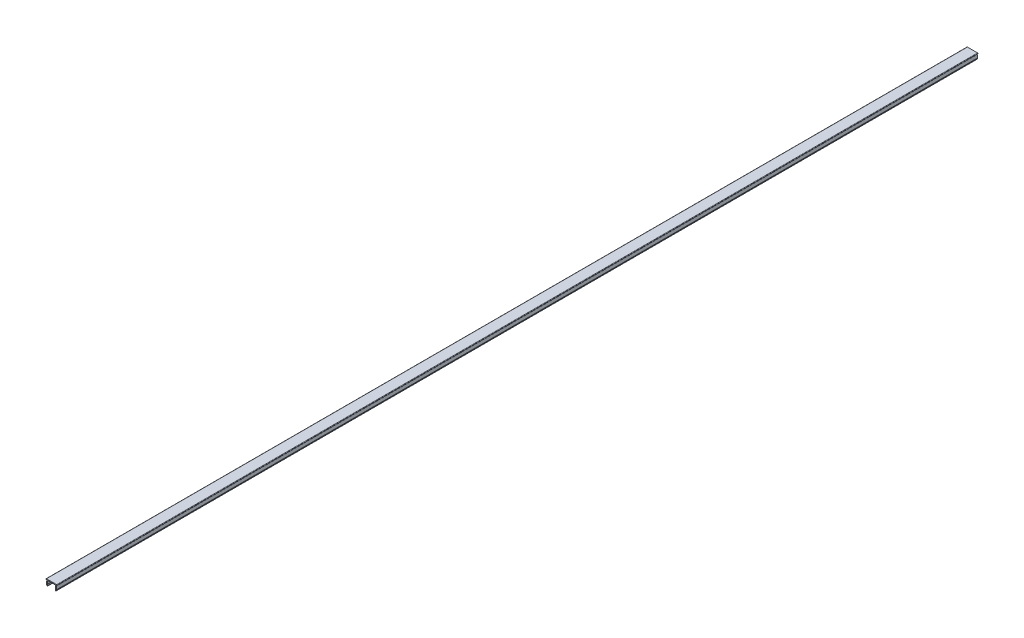
ISO-10303-21;
HEADER;
FILE_DESCRIPTION(('STEP AP214'),'2;1');
FILE_NAME('part.step','',(''),(''),'','','');
FILE_SCHEMA(('AUTOMOTIVE_DESIGN { 1 0 10303 214 1 1 1 1 }'));
ENDSEC;
DATA;
#1=APPLICATION_CONTEXT('core data for automotive mechanical design processes');
#2=APPLICATION_PROTOCOL_DEFINITION('international standard','automotive_design',2000,#1);
#3=PRODUCT_CONTEXT('',#1,'mechanical');
#4=PRODUCT('Part','Part','',(#3));
#5=PRODUCT_RELATED_PRODUCT_CATEGORY('part','',(#4));
#6=PRODUCT_DEFINITION_FORMATION('','',#4);
#7=PRODUCT_DEFINITION_CONTEXT('part definition',#1,'design');
#8=PRODUCT_DEFINITION('design','',#6,#7);
#9=PRODUCT_DEFINITION_SHAPE('','',#8);
#10=(LENGTH_UNIT() NAMED_UNIT(*) SI_UNIT(.MILLI.,.METRE.));
#11=(NAMED_UNIT(*) PLANE_ANGLE_UNIT() SI_UNIT($,.RADIAN.));
#12=(NAMED_UNIT(*) SI_UNIT($,.STERADIAN.) SOLID_ANGLE_UNIT());
#13=UNCERTAINTY_MEASURE_WITH_UNIT(LENGTH_MEASURE(1.E-05),#10,'distance_accuracy_value','');
#14=(GEOMETRIC_REPRESENTATION_CONTEXT(3) GLOBAL_UNCERTAINTY_ASSIGNED_CONTEXT((#13)) GLOBAL_UNIT_ASSIGNED_CONTEXT((#10,
#11,#12)) REPRESENTATION_CONTEXT('',''));
#15=CARTESIAN_POINT('',(0.,0.,0.));
#16=DIRECTION('',(0.,0.,1.));
#17=DIRECTION('',(1.,0.,0.));
#18=AXIS2_PLACEMENT_3D('',#15,#16,#17);
#19=CARTESIAN_POINT('',(-2.12833862518597,5.64999984480356,1000.));
#20=DIRECTION('',(0.,1.,0.));
#21=DIRECTION('',(-1.,0.,0.));
#22=AXIS2_PLACEMENT_3D('',#19,#20,#21);
#23=PLANE('',#22);
#24=DIRECTION('',(1.,0.,0.));
#25=VECTOR('',#24,1.);
#26=CARTESIAN_POINT('',(-2.12833862518597,5.64999984480356,0.));
#27=LINE('',#26,#25);
#28=CARTESIAN_POINT('',(0.26212001769372,5.64999984480356,0.));
#29=VERTEX_POINT('',#28);
#30=CARTESIAN_POINT('',(7.48120273193434,5.64999984480356,0.));
#31=VERTEX_POINT('',#30);
#32=EDGE_CURVE('E203',#29,#31,#27,.T.);
#33=ORIENTED_EDGE('',*,*,#32,.T.);
#34=DIRECTION('',(0.,0.,-1.));
#35=VECTOR('',#34,1.);
#36=CARTESIAN_POINT('',(7.48120273193434,5.64999984480356,1000.));
#37=LINE('',#36,#35);
#38=CARTESIAN_POINT('',(7.48120273193434,5.64999984480356,1000.));
#39=VERTEX_POINT('',#38);
#40=EDGE_CURVE('E245',#31,#39,#37,.F.);
#41=ORIENTED_EDGE('',*,*,#40,.T.);
#42=DIRECTION('',(1.,0.,0.));
#43=VECTOR('',#42,1.);
#44=CARTESIAN_POINT('',(-2.12833862518597,5.64999984480356,1000.));
#45=LINE('',#44,#43);
#46=CARTESIAN_POINT('',(0.26212001769372,5.64999984480356,1000.));
#47=VERTEX_POINT('',#46);
#48=EDGE_CURVE('E232',#47,#39,#45,.T.);
#49=ORIENTED_EDGE('',*,*,#48,.F.);
#50=DIRECTION('',(0.,0.,-1.));
#51=VECTOR('',#50,1.);
#52=CARTESIAN_POINT('',(0.26212001769372,5.64999984480356,1000.));
#53=LINE('',#52,#51);
#54=EDGE_CURVE('E242',#47,#29,#53,.T.);
#55=ORIENTED_EDGE('',*,*,#54,.T.);
#56=EDGE_LOOP('',(#33,#41,#49,#55));
#57=FACE_BOUND('',#56,.T.);
#58=ADVANCED_FACE('F16',(#57),#23,.F.);
#59=CARTESIAN_POINT('',(-1.62833862518597,5.64999984480356,1000.));
#60=VERTEX_POINT('',#59);
#61=CARTESIAN_POINT('',(-1.18984701639326,5.64999984480356,1000.));
#62=VERTEX_POINT('',#61);
#63=EDGE_CURVE('E230',#60,#62,#45,.T.);
#64=ORIENTED_EDGE('',*,*,#63,.F.);
#65=DIRECTION('',(0.,0.,-1.));
#66=VECTOR('',#65,1.);
#67=CARTESIAN_POINT('',(-1.62833862518597,5.64999984480356,0.));
#68=LINE('',#67,#66);
#69=CARTESIAN_POINT('',(-1.62833862518597,5.64999984480356,0.));
#70=VERTEX_POINT('',#69);
#71=EDGE_CURVE('E198',#60,#70,#68,.T.);
#72=ORIENTED_EDGE('',*,*,#71,.T.);
#73=CARTESIAN_POINT('',(-1.18984701639326,5.64999984480356,0.));
#74=VERTEX_POINT('',#73);
#75=EDGE_CURVE('E191',#70,#74,#27,.T.);
#76=ORIENTED_EDGE('',*,*,#75,.T.);
#77=DIRECTION('',(0.,0.,-1.));
#78=VECTOR('',#77,1.);
#79=CARTESIAN_POINT('',(-1.18984701639326,5.64999984480356,1000.));
#80=LINE('',#79,#78);
#81=EDGE_CURVE('E195',#62,#74,#80,.T.);
#82=ORIENTED_EDGE('',*,*,#81,.F.);
#83=EDGE_LOOP('',(#64,#72,#76,#82));
#84=FACE_BOUND('',#83,.T.);
#85=ADVANCED_FACE('F194',(#84),#23,.F.);
#86=CARTESIAN_POINT('',(8.93316976602132,5.64999984480356,0.));
#87=VERTEX_POINT('',#86);
#88=CARTESIAN_POINT('',(9.37166137481403,5.64999984480356,0.));
#89=VERTEX_POINT('',#88);
#90=EDGE_CURVE('E205',#87,#89,#27,.T.);
#91=ORIENTED_EDGE('',*,*,#90,.T.);
#92=DIRECTION('',(0.,0.,-1.));
#93=VECTOR('',#92,1.);
#94=CARTESIAN_POINT('',(9.37166137481403,5.64999984480356,1000.));
#95=LINE('',#94,#93);
#96=CARTESIAN_POINT('',(9.37166137481403,5.64999984480356,1000.));
#97=VERTEX_POINT('',#96);
#98=EDGE_CURVE('E320',#89,#97,#95,.F.);
#99=ORIENTED_EDGE('',*,*,#98,.T.);
#100=CARTESIAN_POINT('',(8.93316976602132,5.64999984480356,1000.));
#101=VERTEX_POINT('',#100);
#102=EDGE_CURVE('E233',#101,#97,#45,.T.);
#103=ORIENTED_EDGE('',*,*,#102,.F.);
#104=DIRECTION('',(0.,0.,-1.));
#105=VECTOR('',#104,1.);
#106=CARTESIAN_POINT('',(8.93316976602132,5.64999984480356,1000.));
#107=LINE('',#106,#105);
#108=EDGE_CURVE('E410',#101,#87,#107,.T.);
#109=ORIENTED_EDGE('',*,*,#108,.T.);
#110=EDGE_LOOP('',(#91,#99,#103,#109));
#111=FACE_BOUND('',#110,.T.);
#112=ADVANCED_FACE('F371',(#111),#23,.F.);
#113=CARTESIAN_POINT('',(-2.12833862518597,6.64999984480356,1000.));
#114=DIRECTION('',(0.,1.,0.));
#115=DIRECTION('',(-1.,0.,0.));
#116=AXIS2_PLACEMENT_3D('',#113,#114,#115);
#117=PLANE('',#116);
#118=DIRECTION('',(1.,0.,0.));
#119=VECTOR('',#118,1.);
#120=CARTESIAN_POINT('',(-2.12833862518597,6.64999984480356,1000.));
#121=LINE('',#120,#119);
#122=CARTESIAN_POINT('',(-1.62833862518597,6.64999984480356,1000.));
#123=VERTEX_POINT('',#122);
#124=CARTESIAN_POINT('',(9.37166137481403,6.64999984480356,1000.));
#125=VERTEX_POINT('',#124);
#126=EDGE_CURVE('E214',#123,#125,#121,.T.);
#127=ORIENTED_EDGE('',*,*,#126,.T.);
#128=DIRECTION('',(0.,0.,-1.));
#129=VECTOR('',#128,1.);
#130=CARTESIAN_POINT('',(9.37166137481403,6.64999984480356,1000.));
#131=LINE('',#130,#129);
#132=CARTESIAN_POINT('',(9.37166137481403,6.64999984480356,0.));
#133=VERTEX_POINT('',#132);
#134=EDGE_CURVE('E317',#125,#133,#131,.T.);
#135=ORIENTED_EDGE('',*,*,#134,.T.);
#136=DIRECTION('',(1.,0.,0.));
#137=VECTOR('',#136,1.);
#138=CARTESIAN_POINT('',(-2.12833862518597,6.64999984480356,0.));
#139=LINE('',#138,#137);
#140=CARTESIAN_POINT('',(-1.62833862518597,6.64999984480356,0.));
#141=VERTEX_POINT('',#140);
#142=EDGE_CURVE('E202',#141,#133,#139,.T.);
#143=ORIENTED_EDGE('',*,*,#142,.F.);
#144=DIRECTION('',(0.,0.,-1.));
#145=VECTOR('',#144,1.);
#146=CARTESIAN_POINT('',(-1.62833862518597,6.64999984480356,1000.));
#147=LINE('',#146,#145);
#148=EDGE_CURVE('E314',#141,#123,#147,.F.);
#149=ORIENTED_EDGE('',*,*,#148,.T.);
#150=EDGE_LOOP('',(#127,#135,#143,#149));
#151=FACE_BOUND('',#150,.T.);
#152=ADVANCED_FACE('F359',(#151),#117,.T.);
#153=CARTESIAN_POINT('',(0.,0.,1000.));
#154=DIRECTION('',(0.,0.,-1.));
#155=DIRECTION('',(-1.,0.,0.));
#156=AXIS2_PLACEMENT_3D('',#153,#154,#155);
#157=PLANE('',#156);
#158=DIRECTION('',(0.334719806751246,-0.942317701716575,0.));
#159=VECTOR('',#158,1.);
#160=CARTESIAN_POINT('',(-1.59949747604426,1.68263994142794,1000.));
#161=LINE('',#160,#159);
#162=CARTESIAN_POINT('',(-1.59949747604426,1.68263994142794,1000.));
#163=VERTEX_POINT('',#162);
#164=CARTESIAN_POINT('',(-1.19852284656922,0.553798792286223,1000.));
#165=VERTEX_POINT('',#164);
#166=EDGE_CURVE('E219',#163,#165,#161,.T.);
#167=ORIENTED_EDGE('',*,*,#166,.T.);
#168=CARTESIAN_POINT('',(-0.727363995710937,0.721158695661846,1000.));
#169=DIRECTION('',(0.,0.,-1.));
#170=DIRECTION('',(-1.,0.,0.));
#171=AXIS2_PLACEMENT_3D('',#168,#169,#170);
#172=CIRCLE('',#171,0.5);
#173=CARTESIAN_POINT('',(-0.560004092335314,0.249999844803559,1000.));
#174=VERTEX_POINT('',#173);
#175=EDGE_CURVE('E294',#165,#174,#172,.F.);
#176=ORIENTED_EDGE('',*,*,#175,.T.);
#177=CARTESIAN_POINT('',(-0.727363995710937,0.721158695661846,1000.));
#178=DIRECTION('',(0.,0.,-1.));
#179=DIRECTION('',(-1.,0.,0.));
#180=AXIS2_PLACEMENT_3D('',#177,#178,#179);
#181=CIRCLE('',#180,0.5);
#182=CARTESIAN_POINT('',(-0.25620514485265,0.888518599037469,1000.));
#183=VERTEX_POINT('',#182);
#184=EDGE_CURVE('E33',#174,#183,#181,.F.);
#185=ORIENTED_EDGE('',*,*,#184,.T.);
#186=DIRECTION('',(0.334719806751246,-0.942317701716575,0.));
#187=VECTOR('',#186,1.);
#188=CARTESIAN_POINT('',(-0.657179774327682,2.01735974817918,1000.));
#189=LINE('',#188,#187);
#190=CARTESIAN_POINT('',(-0.579324937996317,1.79817943987489,1000.));
#191=VERTEX_POINT('',#190);
#192=EDGE_CURVE('E223',#191,#183,#189,.T.);
#193=ORIENTED_EDGE('',*,*,#192,.F.);
#194=CARTESIAN_POINT('',(-0.108166087138029,1.96553934325051,1000.));
#195=DIRECTION('',(0.,0.,-1.));
#196=DIRECTION('',(-1.,0.,0.));
#197=AXIS2_PLACEMENT_3D('',#194,#195,#196);
#198=CIRCLE('',#197,0.5);
#199=CARTESIAN_POINT('',(-0.604819777288656,2.02328977233779,1000.));
#200=VERTEX_POINT('',#199);
#201=EDGE_CURVE('E10',#191,#200,#198,.T.);
#202=ORIENTED_EDGE('',*,*,#201,.T.);
#203=DIRECTION('',(-0.115500858174564,-0.993307380301254,0.));
#204=VECTOR('',#203,1.);
#205=CARTESIAN_POINT('',(-0.131684935035345,6.09224941571628,1000.));
#206=LINE('',#205,#204);
#207=CARTESIAN_POINT('',(-0.234533672456907,5.20775027389084,1000.));
#208=VERTEX_POINT('',#207);
#209=EDGE_CURVE('E414',#208,#200,#206,.T.);
#210=ORIENTED_EDGE('',*,*,#209,.F.);
#211=CARTESIAN_POINT('',(0.26212001769372,5.14999984480356,1000.));
#212=DIRECTION('',(0.,0.,-1.));
#213=DIRECTION('',(-1.,0.,0.));
#214=AXIS2_PLACEMENT_3D('',#211,#212,#213);
#215=CIRCLE('',#214,0.5);
#216=EDGE_CURVE('E329',#208,#47,#215,.T.);
#217=ORIENTED_EDGE('',*,*,#216,.T.);
#218=ORIENTED_EDGE('',*,*,#48,.T.);
#219=CARTESIAN_POINT('',(7.48120273193434,5.14999984480356,1000.));
#220=DIRECTION('',(0.,0.,-1.));
#221=DIRECTION('',(-1.,0.,0.));
#222=AXIS2_PLACEMENT_3D('',#219,#220,#221);
#223=CIRCLE('',#222,0.5);
#224=CARTESIAN_POINT('',(7.97785642208496,5.20775027389084,1000.));
#225=VERTEX_POINT('',#224);
#226=EDGE_CURVE('E325',#39,#225,#223,.T.);
#227=ORIENTED_EDGE('',*,*,#226,.T.);
#228=DIRECTION('',(0.115500858174564,-0.993307380301254,0.));
#229=VECTOR('',#228,1.);
#230=CARTESIAN_POINT('',(7.8750076846634,6.09224941571628,1000.));
#231=LINE('',#230,#229);
#232=CARTESIAN_POINT('',(8.34814252691671,2.02328977233779,1000.));
#233=VERTEX_POINT('',#232);
#234=EDGE_CURVE('E395',#225,#233,#231,.T.);
#235=ORIENTED_EDGE('',*,*,#234,.T.);
#236=CARTESIAN_POINT('',(7.85148883676609,1.96553934325051,1000.));
#237=DIRECTION('',(0.,0.,-1.));
#238=DIRECTION('',(-1.,0.,0.));
#239=AXIS2_PLACEMENT_3D('',#236,#237,#238);
#240=CIRCLE('',#239,0.5);
#241=CARTESIAN_POINT('',(8.32264768762438,1.79817943987488,1000.));
#242=VERTEX_POINT('',#241);
#243=EDGE_CURVE('E333',#233,#242,#240,.T.);
#244=ORIENTED_EDGE('',*,*,#243,.T.);
#245=DIRECTION('',(-0.334719806751245,-0.942317701716576,0.));
#246=VECTOR('',#245,1.);
#247=CARTESIAN_POINT('',(8.40050252395574,2.01735974817918,1000.));
#248=LINE('',#247,#246);
#249=CARTESIAN_POINT('',(7.99952789448071,0.888518599037471,1000.));
#250=VERTEX_POINT('',#249);
#251=EDGE_CURVE('E399',#242,#250,#248,.T.);
#252=ORIENTED_EDGE('',*,*,#251,.T.);
#253=CARTESIAN_POINT('',(8.470686745339,0.721158695661848,1000.));
#254=DIRECTION('',(0.,0.,-1.));
#255=DIRECTION('',(-1.,0.,0.));
#256=AXIS2_PLACEMENT_3D('',#253,#254,#255);
#257=CIRCLE('',#256,0.5);
#258=CARTESIAN_POINT('',(8.30332684196338,0.24999984480356,1000.));
#259=VERTEX_POINT('',#258);
#260=EDGE_CURVE('E289',#250,#259,#257,.F.);
#261=ORIENTED_EDGE('',*,*,#260,.T.);
#262=CARTESIAN_POINT('',(8.470686745339,0.721158695661848,1000.));
#263=DIRECTION('',(0.,0.,-1.));
#264=DIRECTION('',(-1.,0.,0.));
#265=AXIS2_PLACEMENT_3D('',#262,#263,#264);
#266=CIRCLE('',#265,0.5);
#267=CARTESIAN_POINT('',(8.94184559619729,0.553798792286225,1000.));
#268=VERTEX_POINT('',#267);
#269=EDGE_CURVE('E291',#259,#268,#266,.F.);
#270=ORIENTED_EDGE('',*,*,#269,.T.);
#271=DIRECTION('',(-0.334719806751245,-0.942317701716576,0.));
#272=VECTOR('',#271,1.);
#273=CARTESIAN_POINT('',(9.34282022567232,1.68263994142794,1000.));
#274=LINE('',#273,#272);
#275=CARTESIAN_POINT('',(9.34282022567232,1.68263994142794,1000.));
#276=VERTEX_POINT('',#275);
#277=EDGE_CURVE('E403',#276,#268,#274,.T.);
#278=ORIENTED_EDGE('',*,*,#277,.F.);
#279=CARTESIAN_POINT('',(8.87166137481403,1.84999984480356,1000.));
#280=DIRECTION('',(0.,0.,-1.));
#281=DIRECTION('',(-1.,0.,0.));
#282=AXIS2_PLACEMENT_3D('',#279,#280,#281);
#283=CIRCLE('',#282,0.5);
#284=CARTESIAN_POINT('',(9.36831506496466,1.90775027389084,1000.));
#285=VERTEX_POINT('',#284);
#286=EDGE_CURVE('E285',#276,#285,#283,.F.);
#287=ORIENTED_EDGE('',*,*,#286,.T.);
#288=DIRECTION('',(0.115500858174564,-0.993307380301254,0.));
#289=VECTOR('',#288,1.);
#290=CARTESIAN_POINT('',(8.86831506496466,6.20775027389084,1000.));
#291=LINE('',#290,#289);
#292=EDGE_CURVE('E375',#101,#285,#291,.T.);
#293=ORIENTED_EDGE('',*,*,#292,.F.);
#294=ORIENTED_EDGE('',*,*,#102,.T.);
#295=CARTESIAN_POINT('',(9.37166137481403,6.14999984480356,1000.));
#296=DIRECTION('',(0.,0.,-1.));
#297=DIRECTION('',(-1.,0.,0.));
#298=AXIS2_PLACEMENT_3D('',#295,#296,#297);
#299=CIRCLE('',#298,0.5);
#300=CARTESIAN_POINT('',(9.87166137481403,6.14999984480356,1000.));
#301=VERTEX_POINT('',#300);
#302=EDGE_CURVE('E281',#97,#301,#299,.F.);
#303=ORIENTED_EDGE('',*,*,#302,.T.);
#304=CARTESIAN_POINT('',(9.37166137481403,6.14999984480356,1000.));
#305=DIRECTION('',(0.,0.,-1.));
#306=DIRECTION('',(-1.,0.,0.));
#307=AXIS2_PLACEMENT_3D('',#304,#305,#306);
#308=CIRCLE('',#307,0.5);
#309=EDGE_CURVE('E283',#301,#125,#308,.F.);
#310=ORIENTED_EDGE('',*,*,#309,.T.);
#311=ORIENTED_EDGE('',*,*,#126,.F.);
#312=CARTESIAN_POINT('',(-1.62833862518597,6.14999984480356,1000.));
#313=DIRECTION('',(0.,0.,-1.));
#314=DIRECTION('',(-1.,0.,0.));
#315=AXIS2_PLACEMENT_3D('',#312,#313,#314);
#316=CIRCLE('',#315,0.5);
#317=CARTESIAN_POINT('',(-2.12833862518597,6.14999984480356,1000.));
#318=VERTEX_POINT('',#317);
#319=EDGE_CURVE('E279',#123,#318,#316,.F.);
#320=ORIENTED_EDGE('',*,*,#319,.T.);
#321=CARTESIAN_POINT('',(-1.62833862518597,6.14999984480356,1000.));
#322=DIRECTION('',(0.,0.,-1.));
#323=DIRECTION('',(-1.,0.,0.));
#324=AXIS2_PLACEMENT_3D('',#321,#322,#323);
#325=CIRCLE('',#324,0.5);
#326=EDGE_CURVE('E277',#318,#60,#325,.F.);
#327=ORIENTED_EDGE('',*,*,#326,.T.);
#328=ORIENTED_EDGE('',*,*,#63,.T.);
#329=DIRECTION('',(-0.115500858174564,-0.993307380301254,0.));
#330=VECTOR('',#329,1.);
#331=CARTESIAN_POINT('',(-1.1249923153366,6.20775027389084,1000.));
#332=LINE('',#331,#330);
#333=CARTESIAN_POINT('',(-1.6249923153366,1.90775027389084,1000.));
#334=VERTEX_POINT('',#333);
#335=EDGE_CURVE('E212',#62,#334,#332,.T.);
#336=ORIENTED_EDGE('',*,*,#335,.T.);
#337=CARTESIAN_POINT('',(-1.12833862518597,1.84999984480356,1000.));
#338=DIRECTION('',(0.,0.,-1.));
#339=DIRECTION('',(-1.,0.,0.));
#340=AXIS2_PLACEMENT_3D('',#337,#338,#339);
#341=CIRCLE('',#340,0.5);
#342=EDGE_CURVE('E287',#334,#163,#341,.F.);
#343=ORIENTED_EDGE('',*,*,#342,.T.);
#344=EDGE_LOOP('',(#167,#176,#185,#193,#202,#210,#217,#218,#227,#235,#244,#252,#261,#270,#278,
#287,#293,#294,#303,#310,#311,#320,#327,#328,#336,#343));
#345=FACE_BOUND('',#344,.T.);
#346=ADVANCED_FACE('F355',(#345),#157,.F.);
#347=CARTESIAN_POINT('',(0.,0.,0.));
#348=DIRECTION('',(0.,0.,-1.));
#349=DIRECTION('',(-1.,0.,0.));
#350=AXIS2_PLACEMENT_3D('',#347,#348,#349);
#351=PLANE('',#350);
#352=CARTESIAN_POINT('',(-0.727363995710937,0.721158695661846,0.));
#353=DIRECTION('',(0.,0.,-1.));
#354=DIRECTION('',(-1.,0.,0.));
#355=AXIS2_PLACEMENT_3D('',#352,#353,#354);
#356=CIRCLE('',#355,0.5);
#357=CARTESIAN_POINT('',(-0.25620514485265,0.888518599037469,0.));
#358=VERTEX_POINT('',#357);
#359=CARTESIAN_POINT('',(-0.560004092335314,0.249999844803559,0.));
#360=VERTEX_POINT('',#359);
#361=EDGE_CURVE('E267',#358,#360,#356,.T.);
#362=ORIENTED_EDGE('',*,*,#361,.T.);
#363=CARTESIAN_POINT('',(-0.727363995710937,0.721158695661846,0.));
#364=DIRECTION('',(0.,0.,-1.));
#365=DIRECTION('',(-1.,0.,0.));
#366=AXIS2_PLACEMENT_3D('',#363,#364,#365);
#367=CIRCLE('',#366,0.5);
#368=CARTESIAN_POINT('',(-1.19852284656922,0.553798792286223,0.));
#369=VERTEX_POINT('',#368);
#370=EDGE_CURVE('E269',#360,#369,#367,.T.);
#371=ORIENTED_EDGE('',*,*,#370,.T.);
#372=DIRECTION('',(0.334719806751246,-0.942317701716575,0.));
#373=VECTOR('',#372,1.);
#374=CARTESIAN_POINT('',(-1.59949747604426,1.68263994142794,0.));
#375=LINE('',#374,#373);
#376=CARTESIAN_POINT('',(-1.59949747604426,1.68263994142794,0.));
#377=VERTEX_POINT('',#376);
#378=EDGE_CURVE('E411',#377,#369,#375,.T.);
#379=ORIENTED_EDGE('',*,*,#378,.F.);
#380=CARTESIAN_POINT('',(-1.12833862518597,1.84999984480356,0.));
#381=DIRECTION('',(0.,0.,-1.));
#382=DIRECTION('',(-1.,0.,0.));
#383=AXIS2_PLACEMENT_3D('',#380,#381,#382);
#384=CIRCLE('',#383,0.5);
#385=CARTESIAN_POINT('',(-1.6249923153366,1.90775027389084,0.));
#386=VERTEX_POINT('',#385);
#387=EDGE_CURVE('E218',#377,#386,#384,.T.);
#388=ORIENTED_EDGE('',*,*,#387,.T.);
#389=DIRECTION('',(-0.115500858174564,-0.993307380301254,0.));
#390=VECTOR('',#389,1.);
#391=CARTESIAN_POINT('',(-1.1249923153366,6.20775027389084,0.));
#392=LINE('',#391,#390);
#393=EDGE_CURVE('E209',#74,#386,#392,.T.);
#394=ORIENTED_EDGE('',*,*,#393,.F.);
#395=ORIENTED_EDGE('',*,*,#75,.F.);
#396=CARTESIAN_POINT('',(-1.62833862518597,6.14999984480356,0.));
#397=DIRECTION('',(0.,0.,-1.));
#398=DIRECTION('',(-1.,0.,0.));
#399=AXIS2_PLACEMENT_3D('',#396,#397,#398);
#400=CIRCLE('',#399,0.5);
#401=CARTESIAN_POINT('',(-2.12833862518597,6.14999984480356,0.));
#402=VERTEX_POINT('',#401);
#403=EDGE_CURVE('E252',#70,#402,#400,.T.);
#404=ORIENTED_EDGE('',*,*,#403,.T.);
#405=CARTESIAN_POINT('',(-1.62833862518597,6.14999984480356,0.));
#406=DIRECTION('',(0.,0.,-1.));
#407=DIRECTION('',(-1.,0.,0.));
#408=AXIS2_PLACEMENT_3D('',#405,#406,#407);
#409=CIRCLE('',#408,0.5);
#410=EDGE_CURVE('E254',#402,#141,#409,.T.);
#411=ORIENTED_EDGE('',*,*,#410,.T.);
#412=ORIENTED_EDGE('',*,*,#142,.T.);
#413=CARTESIAN_POINT('',(9.37166137481403,6.14999984480356,0.));
#414=DIRECTION('',(0.,0.,-1.));
#415=DIRECTION('',(-1.,0.,0.));
#416=AXIS2_PLACEMENT_3D('',#413,#414,#415);
#417=CIRCLE('',#416,0.5);
#418=CARTESIAN_POINT('',(9.87166137481403,6.14999984480356,0.));
#419=VERTEX_POINT('',#418);
#420=EDGE_CURVE('E258',#133,#419,#417,.T.);
#421=ORIENTED_EDGE('',*,*,#420,.T.);
#422=CARTESIAN_POINT('',(9.37166137481403,6.14999984480356,0.));
#423=DIRECTION('',(0.,0.,-1.));
#424=DIRECTION('',(-1.,0.,0.));
#425=AXIS2_PLACEMENT_3D('',#422,#423,#424);
#426=CIRCLE('',#425,0.5);
#427=EDGE_CURVE('E256',#419,#89,#426,.T.);
#428=ORIENTED_EDGE('',*,*,#427,.T.);
#429=ORIENTED_EDGE('',*,*,#90,.F.);
#430=DIRECTION('',(0.115500858174564,-0.993307380301254,0.));
#431=VECTOR('',#430,1.);
#432=CARTESIAN_POINT('',(8.86831506496466,6.20775027389084,0.));
#433=LINE('',#432,#431);
#434=CARTESIAN_POINT('',(9.36831506496466,1.90775027389084,0.));
#435=VERTEX_POINT('',#434);
#436=EDGE_CURVE('E400',#87,#435,#433,.T.);
#437=ORIENTED_EDGE('',*,*,#436,.T.);
#438=CARTESIAN_POINT('',(8.87166137481403,1.84999984480356,0.));
#439=DIRECTION('',(0.,0.,-1.));
#440=DIRECTION('',(-1.,0.,0.));
#441=AXIS2_PLACEMENT_3D('',#438,#439,#440);
#442=CIRCLE('',#441,0.5);
#443=CARTESIAN_POINT('',(9.34282022567232,1.68263994142794,0.));
#444=VERTEX_POINT('',#443);
#445=EDGE_CURVE('E260',#435,#444,#442,.T.);
#446=ORIENTED_EDGE('',*,*,#445,.T.);
#447=DIRECTION('',(-0.334719806751245,-0.942317701716576,0.));
#448=VECTOR('',#447,1.);
#449=CARTESIAN_POINT('',(9.34282022567232,1.68263994142794,0.));
#450=LINE('',#449,#448);
#451=CARTESIAN_POINT('',(8.94184559619729,0.553798792286225,0.));
#452=VERTEX_POINT('',#451);
#453=EDGE_CURVE('E406',#444,#452,#450,.T.);
#454=ORIENTED_EDGE('',*,*,#453,.T.);
#455=CARTESIAN_POINT('',(8.470686745339,0.721158695661848,0.));
#456=DIRECTION('',(0.,0.,-1.));
#457=DIRECTION('',(-1.,0.,0.));
#458=AXIS2_PLACEMENT_3D('',#455,#456,#457);
#459=CIRCLE('',#458,0.5);
#460=CARTESIAN_POINT('',(8.30332684196338,0.24999984480356,0.));
#461=VERTEX_POINT('',#460);
#462=EDGE_CURVE('E265',#452,#461,#459,.T.);
#463=ORIENTED_EDGE('',*,*,#462,.T.);
#464=CARTESIAN_POINT('',(8.470686745339,0.721158695661848,0.));
#465=DIRECTION('',(0.,0.,-1.));
#466=DIRECTION('',(-1.,0.,0.));
#467=AXIS2_PLACEMENT_3D('',#464,#465,#466);
#468=CIRCLE('',#467,0.5);
#469=CARTESIAN_POINT('',(7.99952789448071,0.888518599037471,0.));
#470=VERTEX_POINT('',#469);
#471=EDGE_CURVE('E263',#461,#470,#468,.T.);
#472=ORIENTED_EDGE('',*,*,#471,.T.);
#473=DIRECTION('',(-0.334719806751245,-0.942317701716576,0.));
#474=VECTOR('',#473,1.);
#475=CARTESIAN_POINT('',(8.40050252395574,2.01735974817918,0.));
#476=LINE('',#475,#474);
#477=CARTESIAN_POINT('',(8.32264768762438,1.79817943987488,0.));
#478=VERTEX_POINT('',#477);
#479=EDGE_CURVE('E339',#478,#470,#476,.T.);
#480=ORIENTED_EDGE('',*,*,#479,.F.);
#481=CARTESIAN_POINT('',(7.85148883676609,1.96553934325051,0.));
#482=DIRECTION('',(0.,0.,-1.));
#483=DIRECTION('',(-1.,0.,0.));
#484=AXIS2_PLACEMENT_3D('',#481,#482,#483);
#485=CIRCLE('',#484,0.5);
#486=CARTESIAN_POINT('',(8.34814252691671,2.02328977233779,0.));
#487=VERTEX_POINT('',#486);
#488=EDGE_CURVE('E331',#478,#487,#485,.F.);
#489=ORIENTED_EDGE('',*,*,#488,.T.);
#490=DIRECTION('',(0.115500858174564,-0.993307380301254,0.));
#491=VECTOR('',#490,1.);
#492=CARTESIAN_POINT('',(7.8750076846634,6.09224941571628,0.));
#493=LINE('',#492,#491);
#494=CARTESIAN_POINT('',(7.97785642208496,5.20775027389084,0.));
#495=VERTEX_POINT('',#494);
#496=EDGE_CURVE('E393',#495,#487,#493,.T.);
#497=ORIENTED_EDGE('',*,*,#496,.F.);
#498=CARTESIAN_POINT('',(7.48120273193434,5.14999984480356,0.));
#499=DIRECTION('',(0.,0.,-1.));
#500=DIRECTION('',(-1.,0.,0.));
#501=AXIS2_PLACEMENT_3D('',#498,#499,#500);
#502=CIRCLE('',#501,0.5);
#503=EDGE_CURVE('E323',#495,#31,#502,.F.);
#504=ORIENTED_EDGE('',*,*,#503,.T.);
#505=ORIENTED_EDGE('',*,*,#32,.F.);
#506=CARTESIAN_POINT('',(0.26212001769372,5.14999984480356,0.));
#507=DIRECTION('',(0.,0.,-1.));
#508=DIRECTION('',(-1.,0.,0.));
#509=AXIS2_PLACEMENT_3D('',#506,#507,#508);
#510=CIRCLE('',#509,0.5);
#511=CARTESIAN_POINT('',(-0.234533672456907,5.20775027389084,0.));
#512=VERTEX_POINT('',#511);
#513=EDGE_CURVE('E327',#29,#512,#510,.F.);
#514=ORIENTED_EDGE('',*,*,#513,.T.);
#515=DIRECTION('',(-0.115500858174564,-0.993307380301254,0.));
#516=VECTOR('',#515,1.);
#517=CARTESIAN_POINT('',(-0.131684935035345,6.09224941571628,0.));
#518=LINE('',#517,#516);
#519=CARTESIAN_POINT('',(-0.604819777288656,2.02328977233779,0.));
#520=VERTEX_POINT('',#519);
#521=EDGE_CURVE('E220',#512,#520,#518,.T.);
#522=ORIENTED_EDGE('',*,*,#521,.T.);
#523=CARTESIAN_POINT('',(-0.108166087138029,1.96553934325051,0.));
#524=DIRECTION('',(0.,0.,-1.));
#525=DIRECTION('',(-1.,0.,0.));
#526=AXIS2_PLACEMENT_3D('',#523,#524,#525);
#527=CIRCLE('',#526,0.5);
#528=CARTESIAN_POINT('',(-0.579324937996317,1.79817943987489,0.));
#529=VERTEX_POINT('',#528);
#530=EDGE_CURVE('E25',#520,#529,#527,.F.);
#531=ORIENTED_EDGE('',*,*,#530,.T.);
#532=DIRECTION('',(0.334719806751246,-0.942317701716575,0.));
#533=VECTOR('',#532,1.);
#534=CARTESIAN_POINT('',(-0.657179774327682,2.01735974817918,0.));
#535=LINE('',#534,#533);
#536=EDGE_CURVE('E226',#529,#358,#535,.T.);
#537=ORIENTED_EDGE('',*,*,#536,.T.);
#538=EDGE_LOOP('',(#362,#371,#379,#388,#394,#395,#404,#411,#412,#421,#428,#429,#437,#446,#454,
#463,#472,#480,#489,#497,#504,#505,#514,#522,#531,#537));
#539=FACE_BOUND('',#538,.T.);
#540=ADVANCED_FACE('F216',(#539),#351,.T.);
#541=CARTESIAN_POINT('',(-0.131684935035345,6.09224941571628,1000.));
#542=DIRECTION('',(0.993307380301254,-0.115500858174564,0.));
#543=DIRECTION('',(0.115500858174564,0.993307380301254,0.));
#544=AXIS2_PLACEMENT_3D('',#541,#542,#543);
#545=PLANE('',#544);
#546=ORIENTED_EDGE('',*,*,#521,.F.);
#547=DIRECTION('',(0.,0.,-1.));
#548=VECTOR('',#547,1.);
#549=CARTESIAN_POINT('',(-0.234533672456907,5.20775027389084,1000.));
#550=LINE('',#549,#548);
#551=EDGE_CURVE('E250',#512,#208,#550,.F.);
#552=ORIENTED_EDGE('',*,*,#551,.T.);
#553=ORIENTED_EDGE('',*,*,#209,.T.);
#554=DIRECTION('',(0.,0.,-1.));
#555=VECTOR('',#554,1.);
#556=CARTESIAN_POINT('',(-0.604819777288656,2.02328977233779,0.));
#557=LINE('',#556,#555);
#558=EDGE_CURVE('E247',#200,#520,#557,.T.);
#559=ORIENTED_EDGE('',*,*,#558,.T.);
#560=EDGE_LOOP('',(#546,#552,#553,#559));
#561=FACE_BOUND('',#560,.T.);
#562=ADVANCED_FACE('F467',(#561),#545,.T.);
#563=CARTESIAN_POINT('',(-1.1249923153366,6.20775027389084,1000.));
#564=DIRECTION('',(0.993307380301254,-0.115500858174564,0.));
#565=DIRECTION('',(0.115500858174564,0.993307380301254,0.));
#566=AXIS2_PLACEMENT_3D('',#563,#564,#565);
#567=PLANE('',#566);
#568=ORIENTED_EDGE('',*,*,#393,.T.);
#569=DIRECTION('',(0.,0.,-1.));
#570=VECTOR('',#569,1.);
#571=CARTESIAN_POINT('',(-1.6249923153366,1.90775027389084,1000.));
#572=LINE('',#571,#570);
#573=EDGE_CURVE('E309',#386,#334,#572,.F.);
#574=ORIENTED_EDGE('',*,*,#573,.T.);
#575=ORIENTED_EDGE('',*,*,#335,.F.);
#576=ORIENTED_EDGE('',*,*,#81,.T.);
#577=EDGE_LOOP('',(#568,#574,#575,#576));
#578=FACE_BOUND('',#577,.T.);
#579=ADVANCED_FACE('F208',(#578),#567,.F.);
#580=CARTESIAN_POINT('',(-1.59949747604426,1.68263994142794,1000.));
#581=DIRECTION('',(0.942317701716575,0.334719806751246,0.));
#582=DIRECTION('',(-0.334719806751246,0.942317701716575,0.));
#583=AXIS2_PLACEMENT_3D('',#580,#581,#582);
#584=PLANE('',#583);
#585=ORIENTED_EDGE('',*,*,#378,.T.);
#586=DIRECTION('',(0.,0.,-1.));
#587=VECTOR('',#586,1.);
#588=CARTESIAN_POINT('',(-1.19852284656922,0.553798792286223,1000.));
#589=LINE('',#588,#587);
#590=EDGE_CURVE('E274',#369,#165,#589,.F.);
#591=ORIENTED_EDGE('',*,*,#590,.T.);
#592=ORIENTED_EDGE('',*,*,#166,.F.);
#593=DIRECTION('',(0.,0.,-1.));
#594=VECTOR('',#593,1.);
#595=CARTESIAN_POINT('',(-1.59949747604426,1.68263994142794,1000.));
#596=LINE('',#595,#594);
#597=EDGE_CURVE('E271',#163,#377,#596,.T.);
#598=ORIENTED_EDGE('',*,*,#597,.T.);
#599=EDGE_LOOP('',(#585,#591,#592,#598));
#600=FACE_BOUND('',#599,.T.);
#601=ADVANCED_FACE('F430',(#600),#584,.F.);
#602=CARTESIAN_POINT('',(-0.657179774327682,2.01735974817918,1000.));
#603=DIRECTION('',(0.942317701716575,0.334719806751246,0.));
#604=DIRECTION('',(-0.334719806751246,0.942317701716575,0.));
#605=AXIS2_PLACEMENT_3D('',#602,#603,#604);
#606=PLANE('',#605);
#607=ORIENTED_EDGE('',*,*,#192,.T.);
#608=DIRECTION('',(0.,0.,-1.));
#609=VECTOR('',#608,1.);
#610=CARTESIAN_POINT('',(-0.25620514485265,0.888518599037469,1000.));
#611=LINE('',#610,#609);
#612=EDGE_CURVE('E297',#183,#358,#611,.T.);
#613=ORIENTED_EDGE('',*,*,#612,.T.);
#614=ORIENTED_EDGE('',*,*,#536,.F.);
#615=DIRECTION('',(0.,0.,-1.));
#616=VECTOR('',#615,1.);
#617=CARTESIAN_POINT('',(-0.579324937996317,1.79817943987489,1000.));
#618=LINE('',#617,#616);
#619=EDGE_CURVE('E40',#529,#191,#618,.F.);
#620=ORIENTED_EDGE('',*,*,#619,.T.);
#621=EDGE_LOOP('',(#607,#613,#614,#620));
#622=FACE_BOUND('',#621,.T.);
#623=ADVANCED_FACE('F471',(#622),#606,.T.);
#624=CARTESIAN_POINT('',(8.86831506496466,6.20775027389084,1000.));
#625=DIRECTION('',(0.993307380301254,0.115500858174564,0.));
#626=DIRECTION('',(-0.115500858174564,0.993307380301254,0.));
#627=AXIS2_PLACEMENT_3D('',#624,#625,#626);
#628=PLANE('',#627);
#629=ORIENTED_EDGE('',*,*,#292,.T.);
#630=DIRECTION('',(0.,0.,-1.));
#631=VECTOR('',#630,1.);
#632=CARTESIAN_POINT('',(9.36831506496466,1.90775027389084,1000.));
#633=LINE('',#632,#631);
#634=EDGE_CURVE('E311',#285,#435,#633,.T.);
#635=ORIENTED_EDGE('',*,*,#634,.T.);
#636=ORIENTED_EDGE('',*,*,#436,.F.);
#637=ORIENTED_EDGE('',*,*,#108,.F.);
#638=EDGE_LOOP('',(#629,#635,#636,#637));
#639=FACE_BOUND('',#638,.T.);
#640=ADVANCED_FACE('F474',(#639),#628,.T.);
#641=CARTESIAN_POINT('',(7.8750076846634,6.09224941571628,1000.));
#642=DIRECTION('',(0.993307380301254,0.115500858174564,0.));
#643=DIRECTION('',(-0.115500858174564,0.993307380301254,0.));
#644=AXIS2_PLACEMENT_3D('',#641,#642,#643);
#645=PLANE('',#644);
#646=ORIENTED_EDGE('',*,*,#234,.F.);
#647=DIRECTION('',(0.,0.,-1.));
#648=VECTOR('',#647,1.);
#649=CARTESIAN_POINT('',(7.97785642208496,5.20775027389084,2.22044604925031E-13));
#650=LINE('',#649,#648);
#651=EDGE_CURVE('E239',#225,#495,#650,.T.);
#652=ORIENTED_EDGE('',*,*,#651,.T.);
#653=ORIENTED_EDGE('',*,*,#496,.T.);
#654=DIRECTION('',(0.,0.,-1.));
#655=VECTOR('',#654,1.);
#656=CARTESIAN_POINT('',(8.34814252691671,2.02328977233779,1000.));
#657=LINE('',#656,#655);
#658=EDGE_CURVE('E213',#487,#233,#657,.F.);
#659=ORIENTED_EDGE('',*,*,#658,.T.);
#660=EDGE_LOOP('',(#646,#652,#653,#659));
#661=FACE_BOUND('',#660,.T.);
#662=ADVANCED_FACE('F392',(#661),#645,.F.);
#663=CARTESIAN_POINT('',(8.40050252395574,2.01735974817918,1000.));
#664=DIRECTION('',(0.942317701716576,-0.334719806751245,0.));
#665=DIRECTION('',(0.334719806751245,0.942317701716576,0.));
#666=AXIS2_PLACEMENT_3D('',#663,#664,#665);
#667=PLANE('',#666);
#668=ORIENTED_EDGE('',*,*,#479,.T.);
#669=DIRECTION('',(0.,0.,-1.));
#670=VECTOR('',#669,1.);
#671=CARTESIAN_POINT('',(7.99952789448071,0.888518599037471,1000.));
#672=LINE('',#671,#670);
#673=EDGE_CURVE('E307',#470,#250,#672,.F.);
#674=ORIENTED_EDGE('',*,*,#673,.T.);
#675=ORIENTED_EDGE('',*,*,#251,.F.);
#676=DIRECTION('',(0.,0.,-1.));
#677=VECTOR('',#676,1.);
#678=CARTESIAN_POINT('',(8.32264768762438,1.79817943987488,2.22044604925031E-13));
#679=LINE('',#678,#677);
#680=EDGE_CURVE('E304',#242,#478,#679,.T.);
#681=ORIENTED_EDGE('',*,*,#680,.T.);
#682=EDGE_LOOP('',(#668,#674,#675,#681));
#683=FACE_BOUND('',#682,.T.);
#684=ADVANCED_FACE('F480',(#683),#667,.F.);
#685=CARTESIAN_POINT('',(9.34282022567232,1.68263994142794,1000.));
#686=DIRECTION('',(0.942317701716576,-0.334719806751245,0.));
#687=DIRECTION('',(0.334719806751245,0.942317701716576,0.));
#688=AXIS2_PLACEMENT_3D('',#685,#686,#687);
#689=PLANE('',#688);
#690=ORIENTED_EDGE('',*,*,#277,.T.);
#691=DIRECTION('',(0.,0.,-1.));
#692=VECTOR('',#691,1.);
#693=CARTESIAN_POINT('',(8.94184559619729,0.553798792286225,1000.));
#694=LINE('',#693,#692);
#695=EDGE_CURVE('E301',#268,#452,#694,.T.);
#696=ORIENTED_EDGE('',*,*,#695,.T.);
#697=ORIENTED_EDGE('',*,*,#453,.F.);
#698=DIRECTION('',(0.,0.,-1.));
#699=VECTOR('',#698,1.);
#700=CARTESIAN_POINT('',(9.34282022567232,1.68263994142794,1000.));
#701=LINE('',#700,#699);
#702=EDGE_CURVE('E299',#444,#276,#701,.F.);
#703=ORIENTED_EDGE('',*,*,#702,.T.);
#704=EDGE_LOOP('',(#690,#696,#697,#703));
#705=FACE_BOUND('',#704,.T.);
#706=ADVANCED_FACE('F483',(#705),#689,.T.);
#707=CARTESIAN_POINT('',(7.48120273193434,5.14999984480356,1000.));
#708=DIRECTION('',(0.,0.,1.));
#709=DIRECTION('',(1.,0.,0.));
#710=AXIS2_PLACEMENT_3D('',#707,#708,#709);
#711=CYLINDRICAL_SURFACE('',#710,0.5);
#712=ORIENTED_EDGE('',*,*,#226,.F.);
#713=ORIENTED_EDGE('',*,*,#40,.F.);
#714=ORIENTED_EDGE('',*,*,#503,.F.);
#715=ORIENTED_EDGE('',*,*,#651,.F.);
#716=EDGE_LOOP('',(#712,#713,#714,#715));
#717=FACE_BOUND('',#716,.T.);
#718=ADVANCED_FACE('F388',(#717),#711,.F.);
#719=CARTESIAN_POINT('',(0.26212001769372,5.14999984480356,1000.));
#720=DIRECTION('',(0.,0.,-1.));
#721=DIRECTION('',(-1.,0.,0.));
#722=AXIS2_PLACEMENT_3D('',#719,#720,#721);
#723=CYLINDRICAL_SURFACE('',#722,0.5);
#724=ORIENTED_EDGE('',*,*,#216,.F.);
#725=ORIENTED_EDGE('',*,*,#551,.F.);
#726=ORIENTED_EDGE('',*,*,#513,.F.);
#727=ORIENTED_EDGE('',*,*,#54,.F.);
#728=EDGE_LOOP('',(#724,#725,#726,#727));
#729=FACE_BOUND('',#728,.T.);
#730=ADVANCED_FACE('F515',(#729),#723,.F.);
#731=CARTESIAN_POINT('',(-0.727363995710937,0.721158695661846,1000.));
#732=DIRECTION('',(0.,0.,-1.));
#733=DIRECTION('',(-1.,0.,0.));
#734=AXIS2_PLACEMENT_3D('',#731,#732,#733);
#735=CYLINDRICAL_SURFACE('',#734,0.5);
#736=ORIENTED_EDGE('',*,*,#612,.F.);
#737=ORIENTED_EDGE('',*,*,#184,.F.);
#738=DIRECTION('',(0.,0.,-1.));
#739=VECTOR('',#738,1.);
#740=CARTESIAN_POINT('',(-0.560004092335314,0.249999844803559,1000.));
#741=LINE('',#740,#739);
#742=EDGE_CURVE('E336',#360,#174,#741,.F.);
#743=ORIENTED_EDGE('',*,*,#742,.F.);
#744=ORIENTED_EDGE('',*,*,#361,.F.);
#745=EDGE_LOOP('',(#736,#737,#743,#744));
#746=FACE_BOUND('',#745,.T.);
#747=ADVANCED_FACE('F424',(#746),#735,.T.);
#748=CARTESIAN_POINT('',(-0.727363995710937,0.721158695661846,1000.));
#749=DIRECTION('',(0.,0.,1.));
#750=DIRECTION('',(1.,0.,0.));
#751=AXIS2_PLACEMENT_3D('',#748,#749,#750);
#752=CYLINDRICAL_SURFACE('',#751,0.5);
#753=ORIENTED_EDGE('',*,*,#175,.F.);
#754=ORIENTED_EDGE('',*,*,#590,.F.);
#755=ORIENTED_EDGE('',*,*,#370,.F.);
#756=ORIENTED_EDGE('',*,*,#742,.T.);
#757=EDGE_LOOP('',(#753,#754,#755,#756));
#758=FACE_BOUND('',#757,.T.);
#759=ADVANCED_FACE('F428',(#758),#752,.T.);
#760=CARTESIAN_POINT('',(8.470686745339,0.721158695661848,1000.));
#761=DIRECTION('',(0.,0.,1.));
#762=DIRECTION('',(1.,0.,0.));
#763=AXIS2_PLACEMENT_3D('',#760,#761,#762);
#764=CYLINDRICAL_SURFACE('',#763,0.5);
#765=DIRECTION('',(0.,0.,-1.));
#766=VECTOR('',#765,1.);
#767=CARTESIAN_POINT('',(8.30332684196338,0.249999844803559,0.));
#768=LINE('',#767,#766);
#769=EDGE_CURVE('E340',#259,#461,#768,.T.);
#770=ORIENTED_EDGE('',*,*,#769,.F.);
#771=ORIENTED_EDGE('',*,*,#260,.F.);
#772=ORIENTED_EDGE('',*,*,#673,.F.);
#773=ORIENTED_EDGE('',*,*,#471,.F.);
#774=EDGE_LOOP('',(#770,#771,#772,#773));
#775=FACE_BOUND('',#774,.T.);
#776=ADVANCED_FACE('F537',(#775),#764,.T.);
#777=CARTESIAN_POINT('',(8.470686745339,0.721158695661848,1000.));
#778=DIRECTION('',(0.,0.,-1.));
#779=DIRECTION('',(-1.,0.,0.));
#780=AXIS2_PLACEMENT_3D('',#777,#778,#779);
#781=CYLINDRICAL_SURFACE('',#780,0.5);
#782=ORIENTED_EDGE('',*,*,#269,.F.);
#783=ORIENTED_EDGE('',*,*,#769,.T.);
#784=ORIENTED_EDGE('',*,*,#462,.F.);
#785=ORIENTED_EDGE('',*,*,#695,.F.);
#786=EDGE_LOOP('',(#782,#783,#784,#785));
#787=FACE_BOUND('',#786,.T.);
#788=ADVANCED_FACE('F545',(#787),#781,.T.);
#789=CARTESIAN_POINT('',(7.85148883676609,1.96553934325051,1000.));
#790=DIRECTION('',(0.,0.,1.));
#791=DIRECTION('',(1.,0.,0.));
#792=AXIS2_PLACEMENT_3D('',#789,#790,#791);
#793=CYLINDRICAL_SURFACE('',#792,0.5);
#794=ORIENTED_EDGE('',*,*,#243,.F.);
#795=ORIENTED_EDGE('',*,*,#658,.F.);
#796=ORIENTED_EDGE('',*,*,#488,.F.);
#797=ORIENTED_EDGE('',*,*,#680,.F.);
#798=EDGE_LOOP('',(#794,#795,#796,#797));
#799=FACE_BOUND('',#798,.T.);
#800=ADVANCED_FACE('F447',(#799),#793,.F.);
#801=CARTESIAN_POINT('',(-0.108166087138029,1.96553934325051,1000.));
#802=DIRECTION('',(0.,0.,1.));
#803=DIRECTION('',(1.,0.,0.));
#804=AXIS2_PLACEMENT_3D('',#801,#802,#803);
#805=CYLINDRICAL_SURFACE('',#804,0.5);
#806=ORIENTED_EDGE('',*,*,#201,.F.);
#807=ORIENTED_EDGE('',*,*,#619,.F.);
#808=ORIENTED_EDGE('',*,*,#530,.F.);
#809=ORIENTED_EDGE('',*,*,#558,.F.);
#810=EDGE_LOOP('',(#806,#807,#808,#809));
#811=FACE_BOUND('',#810,.T.);
#812=ADVANCED_FACE('F438',(#811),#805,.F.);
#813=CARTESIAN_POINT('',(-1.12833862518597,1.84999984480356,1000.));
#814=DIRECTION('',(0.,0.,-1.));
#815=DIRECTION('',(-1.,0.,0.));
#816=AXIS2_PLACEMENT_3D('',#813,#814,#815);
#817=CYLINDRICAL_SURFACE('',#816,0.5);
#818=ORIENTED_EDGE('',*,*,#342,.F.);
#819=ORIENTED_EDGE('',*,*,#573,.F.);
#820=ORIENTED_EDGE('',*,*,#387,.F.);
#821=ORIENTED_EDGE('',*,*,#597,.F.);
#822=EDGE_LOOP('',(#818,#819,#820,#821));
#823=FACE_BOUND('',#822,.T.);
#824=ADVANCED_FACE('F435',(#823),#817,.T.);
#825=CARTESIAN_POINT('',(8.87166137481403,1.84999984480356,1000.));
#826=DIRECTION('',(0.,0.,-1.));
#827=DIRECTION('',(-1.,0.,0.));
#828=AXIS2_PLACEMENT_3D('',#825,#826,#827);
#829=CYLINDRICAL_SURFACE('',#828,0.5);
#830=ORIENTED_EDGE('',*,*,#286,.F.);
#831=ORIENTED_EDGE('',*,*,#702,.F.);
#832=ORIENTED_EDGE('',*,*,#445,.F.);
#833=ORIENTED_EDGE('',*,*,#634,.F.);
#834=EDGE_LOOP('',(#830,#831,#832,#833));
#835=FACE_BOUND('',#834,.T.);
#836=ADVANCED_FACE('F437',(#835),#829,.T.);
#837=CARTESIAN_POINT('',(9.37166137481403,6.14999984480356,1000.));
#838=DIRECTION('',(0.,0.,1.));
#839=DIRECTION('',(1.,0.,0.));
#840=AXIS2_PLACEMENT_3D('',#837,#838,#839);
#841=CYLINDRICAL_SURFACE('',#840,0.5);
#842=DIRECTION('',(0.,0.,-1.));
#843=VECTOR('',#842,1.);
#844=CARTESIAN_POINT('',(9.87166137481403,6.14999984480356,0.));
#845=LINE('',#844,#843);
#846=EDGE_CURVE('E342',#301,#419,#845,.T.);
#847=ORIENTED_EDGE('',*,*,#846,.F.);
#848=ORIENTED_EDGE('',*,*,#302,.F.);
#849=ORIENTED_EDGE('',*,*,#98,.F.);
#850=ORIENTED_EDGE('',*,*,#427,.F.);
#851=EDGE_LOOP('',(#847,#848,#849,#850));
#852=FACE_BOUND('',#851,.T.);
#853=ADVANCED_FACE('F367',(#852),#841,.T.);
#854=CARTESIAN_POINT('',(9.37166137481403,6.14999984480356,1000.));
#855=DIRECTION('',(0.,0.,-1.));
#856=DIRECTION('',(-1.,0.,0.));
#857=AXIS2_PLACEMENT_3D('',#854,#855,#856);
#858=CYLINDRICAL_SURFACE('',#857,0.5);
#859=ORIENTED_EDGE('',*,*,#309,.F.);
#860=ORIENTED_EDGE('',*,*,#846,.T.);
#861=ORIENTED_EDGE('',*,*,#420,.F.);
#862=ORIENTED_EDGE('',*,*,#134,.F.);
#863=EDGE_LOOP('',(#859,#860,#861,#862));
#864=FACE_BOUND('',#863,.T.);
#865=ADVANCED_FACE('F361',(#864),#858,.T.);
#866=CARTESIAN_POINT('',(-1.62833862518597,6.14999984480356,1000.));
#867=DIRECTION('',(0.,0.,1.));
#868=DIRECTION('',(1.,0.,0.));
#869=AXIS2_PLACEMENT_3D('',#866,#867,#868);
#870=CYLINDRICAL_SURFACE('',#869,0.5);
#871=ORIENTED_EDGE('',*,*,#71,.F.);
#872=ORIENTED_EDGE('',*,*,#326,.F.);
#873=DIRECTION('',(0.,0.,-1.));
#874=VECTOR('',#873,1.);
#875=CARTESIAN_POINT('',(-2.12833862518597,6.14999984480356,1000.));
#876=LINE('',#875,#874);
#877=EDGE_CURVE('E20',#402,#318,#876,.F.);
#878=ORIENTED_EDGE('',*,*,#877,.F.);
#879=ORIENTED_EDGE('',*,*,#403,.F.);
#880=EDGE_LOOP('',(#871,#872,#878,#879));
#881=FACE_BOUND('',#880,.T.);
#882=ADVANCED_FACE('F18',(#881),#870,.T.);
#883=CARTESIAN_POINT('',(-1.62833862518597,6.14999984480356,1000.));
#884=DIRECTION('',(0.,0.,-1.));
#885=DIRECTION('',(-1.,0.,0.));
#886=AXIS2_PLACEMENT_3D('',#883,#884,#885);
#887=CYLINDRICAL_SURFACE('',#886,0.5);
#888=ORIENTED_EDGE('',*,*,#319,.F.);
#889=ORIENTED_EDGE('',*,*,#148,.F.);
#890=ORIENTED_EDGE('',*,*,#410,.F.);
#891=ORIENTED_EDGE('',*,*,#877,.T.);
#892=EDGE_LOOP('',(#888,#889,#890,#891));
#893=FACE_BOUND('',#892,.T.);
#894=ADVANCED_FACE('F351',(#893),#887,.T.);
#895=CLOSED_SHELL('',(#58,#85,#112,#152,#346,#540,#562,#579,#601,#623,#640,#662,#684,#706,#718,
#730,#747,#759,#776,#788,#800,#812,#824,#836,#853,#865,#882,#894));
#896=MANIFOLD_SOLID_BREP('B1',#895);
#897=ADVANCED_BREP_SHAPE_REPRESENTATION('',(#18,#896),#14);
#898=SHAPE_DEFINITION_REPRESENTATION(#9,#897);
ENDSEC;
END-ISO-10303-21;
